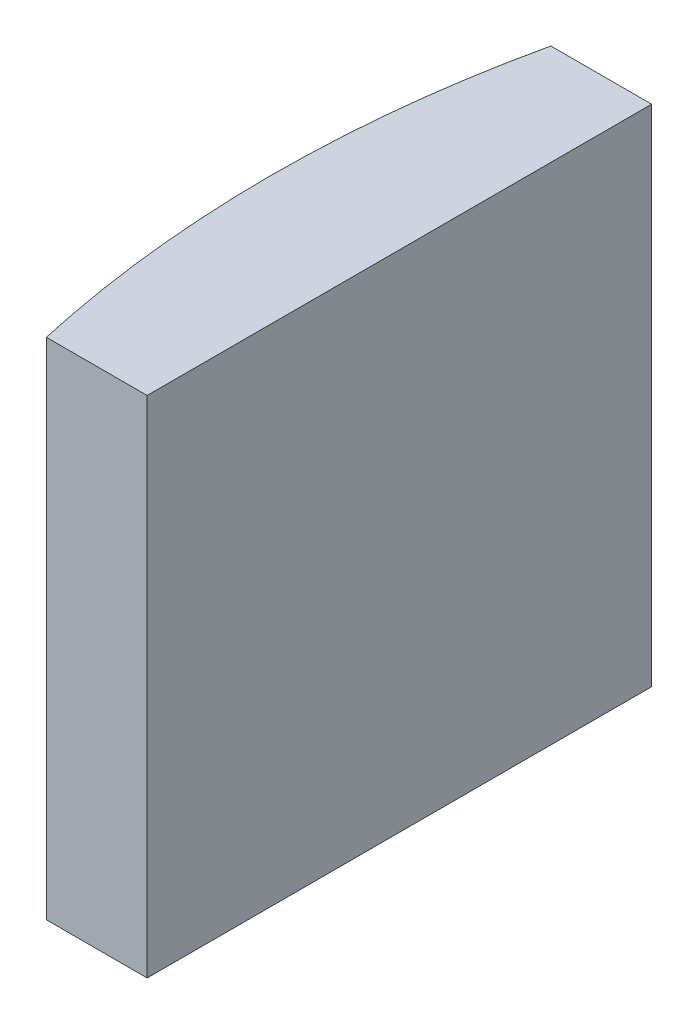
ISO-10303-21;
HEADER;
FILE_DESCRIPTION(('STEP AP214'),'2;1');
FILE_NAME('part.step','',(''),(''),'','','');
FILE_SCHEMA(('AUTOMOTIVE_DESIGN { 1 0 10303 214 1 1 1 1 }'));
ENDSEC;
DATA;
#1=APPLICATION_CONTEXT('core data for automotive mechanical design processes');
#2=APPLICATION_PROTOCOL_DEFINITION('international standard','automotive_design',2000,#1);
#3=PRODUCT_CONTEXT('',#1,'mechanical');
#4=PRODUCT('Part','Part','',(#3));
#5=PRODUCT_RELATED_PRODUCT_CATEGORY('part','',(#4));
#6=PRODUCT_DEFINITION_FORMATION('','',#4);
#7=PRODUCT_DEFINITION_CONTEXT('part definition',#1,'design');
#8=PRODUCT_DEFINITION('design','',#6,#7);
#9=PRODUCT_DEFINITION_SHAPE('','',#8);
#10=(LENGTH_UNIT() NAMED_UNIT(*) SI_UNIT(.MILLI.,.METRE.));
#11=(NAMED_UNIT(*) PLANE_ANGLE_UNIT() SI_UNIT($,.RADIAN.));
#12=(NAMED_UNIT(*) SI_UNIT($,.STERADIAN.) SOLID_ANGLE_UNIT());
#13=UNCERTAINTY_MEASURE_WITH_UNIT(LENGTH_MEASURE(1.E-05),#10,'distance_accuracy_value','');
#14=(GEOMETRIC_REPRESENTATION_CONTEXT(3) GLOBAL_UNCERTAINTY_ASSIGNED_CONTEXT((#13)) GLOBAL_UNIT_ASSIGNED_CONTEXT((#10,
#11,#12)) REPRESENTATION_CONTEXT('',''));
#15=CARTESIAN_POINT('',(0.,0.,0.));
#16=DIRECTION('',(0.,0.,1.));
#17=DIRECTION('',(1.,0.,0.));
#18=AXIS2_PLACEMENT_3D('',#15,#16,#17);
#19=CARTESIAN_POINT('',(4.35520433485127,10.,0.));
#20=DIRECTION('',(0.,-1.,0.));
#21=DIRECTION('',(0.,0.,-1.));
#22=AXIS2_PLACEMENT_3D('',#19,#20,#21);
#23=CYLINDRICAL_SURFACE('',#22,22.92);
#24=CARTESIAN_POINT('',(4.35520433485127,0.,0.));
#25=DIRECTION('',(0.,1.,0.));
#26=DIRECTION('',(0.,0.,1.));
#27=AXIS2_PLACEMENT_3D('',#24,#25,#26);
#28=CIRCLE('',#27,22.92);
#29=CARTESIAN_POINT('',(-18.0127727752944,0.,-5.));
#30=VERTEX_POINT('',#29);
#31=CARTESIAN_POINT('',(-18.0127727752944,0.,5.));
#32=VERTEX_POINT('',#31);
#33=EDGE_CURVE('E100',#30,#32,#28,.T.);
#34=ORIENTED_EDGE('',*,*,#33,.T.);
#35=DIRECTION('',(0.,-1.,0.));
#36=VECTOR('',#35,1.);
#37=CARTESIAN_POINT('',(-18.0127727752944,10.,5.));
#38=LINE('',#37,#36);
#39=CARTESIAN_POINT('',(-18.0127727752944,10.,5.));
#40=VERTEX_POINT('',#39);
#41=EDGE_CURVE('E11',#40,#32,#38,.T.);
#42=ORIENTED_EDGE('',*,*,#41,.F.);
#43=CARTESIAN_POINT('',(4.35520433485127,10.,0.));
#44=DIRECTION('',(0.,1.,0.));
#45=DIRECTION('',(0.,0.,1.));
#46=AXIS2_PLACEMENT_3D('',#43,#44,#45);
#47=CIRCLE('',#46,22.92);
#48=CARTESIAN_POINT('',(-18.0127727752944,10.,-5.));
#49=VERTEX_POINT('',#48);
#50=EDGE_CURVE('E88',#49,#40,#47,.T.);
#51=ORIENTED_EDGE('',*,*,#50,.F.);
#52=DIRECTION('',(0.,-1.,0.));
#53=VECTOR('',#52,1.);
#54=CARTESIAN_POINT('',(-18.0127727752944,10.,-5.));
#55=LINE('',#54,#53);
#56=EDGE_CURVE('E96',#49,#30,#55,.T.);
#57=ORIENTED_EDGE('',*,*,#56,.T.);
#58=EDGE_LOOP('',(#34,#42,#51,#57));
#59=FACE_BOUND('',#58,.T.);
#60=ADVANCED_FACE('F37',(#59),#23,.T.);
#61=CARTESIAN_POINT('',(-18.0127727752944,10.,5.));
#62=DIRECTION('',(0.,0.,-1.));
#63=DIRECTION('',(-1.,0.,0.));
#64=AXIS2_PLACEMENT_3D('',#61,#62,#63);
#65=PLANE('',#64);
#66=DIRECTION('',(1.,0.,0.));
#67=VECTOR('',#66,1.);
#68=CARTESIAN_POINT('',(-18.0127727752944,0.,5.));
#69=LINE('',#68,#67);
#70=CARTESIAN_POINT('',(-16.0147956651487,0.,5.));
#71=VERTEX_POINT('',#70);
#72=EDGE_CURVE('E92',#32,#71,#69,.T.);
#73=ORIENTED_EDGE('',*,*,#72,.T.);
#74=DIRECTION('',(0.,-1.,0.));
#75=VECTOR('',#74,1.);
#76=CARTESIAN_POINT('',(-16.0147956651487,10.,5.));
#77=LINE('',#76,#75);
#78=CARTESIAN_POINT('',(-16.0147956651487,10.,5.));
#79=VERTEX_POINT('',#78);
#80=EDGE_CURVE('E45',#79,#71,#77,.T.);
#81=ORIENTED_EDGE('',*,*,#80,.F.);
#82=DIRECTION('',(1.,0.,0.));
#83=VECTOR('',#82,1.);
#84=CARTESIAN_POINT('',(-18.0127727752944,10.,5.));
#85=LINE('',#84,#83);
#86=EDGE_CURVE('E83',#40,#79,#85,.T.);
#87=ORIENTED_EDGE('',*,*,#86,.F.);
#88=ORIENTED_EDGE('',*,*,#41,.T.);
#89=EDGE_LOOP('',(#73,#81,#87,#88));
#90=FACE_BOUND('',#89,.T.);
#91=ADVANCED_FACE('F91',(#90),#65,.F.);
#92=CARTESIAN_POINT('',(-16.0147956651487,10.,-5.));
#93=DIRECTION('',(-1.,0.,0.));
#94=DIRECTION('',(0.,0.,1.));
#95=AXIS2_PLACEMENT_3D('',#92,#93,#94);
#96=PLANE('',#95);
#97=DIRECTION('',(0.,0.,-1.));
#98=VECTOR('',#97,1.);
#99=CARTESIAN_POINT('',(-16.0147956651487,0.,-5.));
#100=LINE('',#99,#98);
#101=CARTESIAN_POINT('',(-16.0147956651487,0.,-5.));
#102=VERTEX_POINT('',#101);
#103=EDGE_CURVE('E70',#71,#102,#100,.T.);
#104=ORIENTED_EDGE('',*,*,#103,.T.);
#105=DIRECTION('',(0.,-1.,0.));
#106=VECTOR('',#105,1.);
#107=CARTESIAN_POINT('',(-16.0147956651487,10.,-5.));
#108=LINE('',#107,#106);
#109=CARTESIAN_POINT('',(-16.0147956651487,10.,-5.));
#110=VERTEX_POINT('',#109);
#111=EDGE_CURVE('E93',#110,#102,#108,.T.);
#112=ORIENTED_EDGE('',*,*,#111,.F.);
#113=DIRECTION('',(0.,0.,-1.));
#114=VECTOR('',#113,1.);
#115=CARTESIAN_POINT('',(-16.0147956651487,10.,-5.));
#116=LINE('',#115,#114);
#117=EDGE_CURVE('E86',#79,#110,#116,.T.);
#118=ORIENTED_EDGE('',*,*,#117,.F.);
#119=ORIENTED_EDGE('',*,*,#80,.T.);
#120=EDGE_LOOP('',(#104,#112,#118,#119));
#121=FACE_BOUND('',#120,.T.);
#122=ADVANCED_FACE('F94',(#121),#96,.F.);
#123=CARTESIAN_POINT('',(-18.0127727752944,10.,-5.));
#124=DIRECTION('',(0.,0.,1.));
#125=DIRECTION('',(1.,0.,0.));
#126=AXIS2_PLACEMENT_3D('',#123,#124,#125);
#127=PLANE('',#126);
#128=DIRECTION('',(-1.,0.,0.));
#129=VECTOR('',#128,1.);
#130=CARTESIAN_POINT('',(-18.0127727752944,0.,-5.));
#131=LINE('',#130,#129);
#132=EDGE_CURVE('E76',#102,#30,#131,.T.);
#133=ORIENTED_EDGE('',*,*,#132,.T.);
#134=ORIENTED_EDGE('',*,*,#56,.F.);
#135=DIRECTION('',(-1.,0.,0.));
#136=VECTOR('',#135,1.);
#137=CARTESIAN_POINT('',(-18.0127727752944,10.,-5.));
#138=LINE('',#137,#136);
#139=EDGE_CURVE('E53',#110,#49,#138,.T.);
#140=ORIENTED_EDGE('',*,*,#139,.F.);
#141=ORIENTED_EDGE('',*,*,#111,.T.);
#142=EDGE_LOOP('',(#133,#134,#140,#141));
#143=FACE_BOUND('',#142,.T.);
#144=ADVANCED_FACE('F107',(#143),#127,.F.);
#145=CARTESIAN_POINT('',(4.35520433485127,10.,0.));
#146=DIRECTION('',(0.,1.,0.));
#147=DIRECTION('',(0.,0.,1.));
#148=AXIS2_PLACEMENT_3D('',#145,#146,#147);
#149=PLANE('',#148);
#150=ORIENTED_EDGE('',*,*,#50,.T.);
#151=ORIENTED_EDGE('',*,*,#86,.T.);
#152=ORIENTED_EDGE('',*,*,#117,.T.);
#153=ORIENTED_EDGE('',*,*,#139,.T.);
#154=EDGE_LOOP('',(#150,#151,#152,#153));
#155=FACE_BOUND('',#154,.T.);
#156=ADVANCED_FACE('F84',(#155),#149,.T.);
#157=CARTESIAN_POINT('',(4.35520433485127,0.,0.));
#158=DIRECTION('',(0.,1.,0.));
#159=DIRECTION('',(0.,0.,1.));
#160=AXIS2_PLACEMENT_3D('',#157,#158,#159);
#161=PLANE('',#160);
#162=ORIENTED_EDGE('',*,*,#33,.F.);
#163=ORIENTED_EDGE('',*,*,#132,.F.);
#164=ORIENTED_EDGE('',*,*,#103,.F.);
#165=ORIENTED_EDGE('',*,*,#72,.F.);
#166=EDGE_LOOP('',(#162,#163,#164,#165));
#167=FACE_BOUND('',#166,.T.);
#168=ADVANCED_FACE('F110',(#167),#161,.F.);
#169=CLOSED_SHELL('',(#60,#91,#122,#144,#156,#168));
#170=MANIFOLD_SOLID_BREP('B2',#169);
#171=ADVANCED_BREP_SHAPE_REPRESENTATION('',(#18,#170),#14);
#172=SHAPE_DEFINITION_REPRESENTATION(#9,#171);
ENDSEC;
END-ISO-10303-21;
